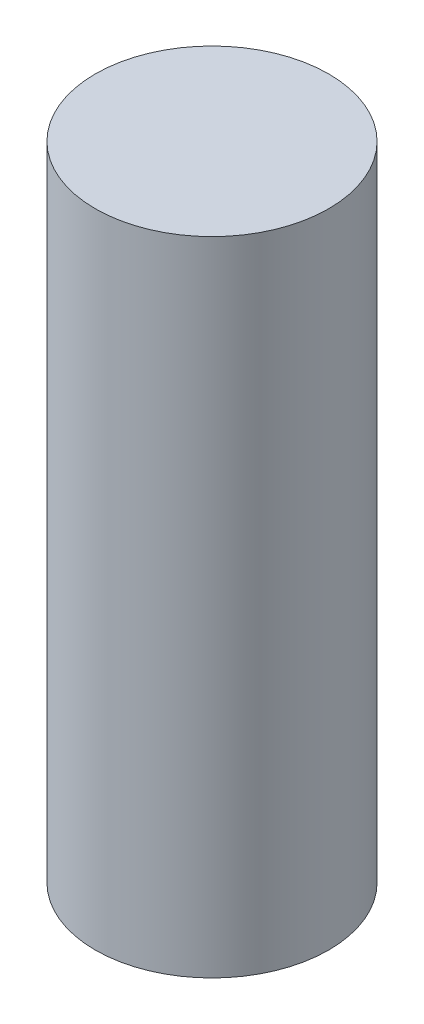
ISO-10303-21;
HEADER;
FILE_DESCRIPTION(('STEP AP214'),'2;1');
FILE_NAME('part.step','',(''),(''),'','','');
FILE_SCHEMA(('AUTOMOTIVE_DESIGN { 1 0 10303 214 1 1 1 1 }'));
ENDSEC;
DATA;
#1=APPLICATION_CONTEXT('core data for automotive mechanical design processes');
#2=APPLICATION_PROTOCOL_DEFINITION('international standard','automotive_design',2000,#1);
#3=PRODUCT_CONTEXT('',#1,'mechanical');
#4=PRODUCT('Part','Part','',(#3));
#5=PRODUCT_RELATED_PRODUCT_CATEGORY('part','',(#4));
#6=PRODUCT_DEFINITION_FORMATION('','',#4);
#7=PRODUCT_DEFINITION_CONTEXT('part definition',#1,'design');
#8=PRODUCT_DEFINITION('design','',#6,#7);
#9=PRODUCT_DEFINITION_SHAPE('','',#8);
#10=(LENGTH_UNIT() NAMED_UNIT(*) SI_UNIT(.MILLI.,.METRE.));
#11=(NAMED_UNIT(*) PLANE_ANGLE_UNIT() SI_UNIT($,.RADIAN.));
#12=(NAMED_UNIT(*) SI_UNIT($,.STERADIAN.) SOLID_ANGLE_UNIT());
#13=UNCERTAINTY_MEASURE_WITH_UNIT(LENGTH_MEASURE(1.E-05),#10,'distance_accuracy_value','');
#14=(GEOMETRIC_REPRESENTATION_CONTEXT(3) GLOBAL_UNCERTAINTY_ASSIGNED_CONTEXT((#13)) GLOBAL_UNIT_ASSIGNED_CONTEXT((#10,
#11,#12)) REPRESENTATION_CONTEXT('',''));
#15=CARTESIAN_POINT('',(0.,0.,0.));
#16=DIRECTION('',(0.,0.,1.));
#17=DIRECTION('',(1.,0.,0.));
#18=AXIS2_PLACEMENT_3D('',#15,#16,#17);
#19=CARTESIAN_POINT('',(0.,11.,0.));
#20=DIRECTION('',(0.,-1.,0.));
#21=DIRECTION('',(0.,0.,-1.));
#22=AXIS2_PLACEMENT_3D('',#19,#20,#21);
#23=CYLINDRICAL_SURFACE('',#22,2.);
#24=CARTESIAN_POINT('',(0.,11.,0.));
#25=DIRECTION('',(0.,1.,0.));
#26=DIRECTION('',(0.,0.,1.));
#27=AXIS2_PLACEMENT_3D('',#24,#25,#26);
#28=CIRCLE('',#27,2.);
#29=CARTESIAN_POINT('',(0.,11.,2.));
#30=VERTEX_POINT('',#29);
#31=EDGE_CURVE('E10',#30,#30,#28,.T.);
#32=ORIENTED_EDGE('',*,*,#31,.F.);
#33=EDGE_LOOP('',(#32));
#34=FACE_BOUND('',#33,.T.);
#35=CARTESIAN_POINT('',(0.,0.,0.));
#36=DIRECTION('',(0.,1.,0.));
#37=DIRECTION('',(0.,0.,1.));
#38=AXIS2_PLACEMENT_3D('',#35,#36,#37);
#39=CIRCLE('',#38,2.);
#40=CARTESIAN_POINT('',(0.,0.,2.));
#41=VERTEX_POINT('',#40);
#42=EDGE_CURVE('E40',#41,#41,#39,.T.);
#43=ORIENTED_EDGE('',*,*,#42,.T.);
#44=EDGE_LOOP('',(#43));
#45=FACE_BOUND('',#44,.T.);
#46=ADVANCED_FACE('F37',(#34,#45),#23,.T.);
#47=CARTESIAN_POINT('',(0.,11.,0.));
#48=DIRECTION('',(0.,1.,0.));
#49=DIRECTION('',(0.,0.,1.));
#50=AXIS2_PLACEMENT_3D('',#47,#48,#49);
#51=PLANE('',#50);
#52=ORIENTED_EDGE('',*,*,#31,.T.);
#53=EDGE_LOOP('',(#52));
#54=FACE_BOUND('',#53,.T.);
#55=ADVANCED_FACE('F54',(#54),#51,.T.);
#56=CARTESIAN_POINT('',(0.,0.,0.));
#57=DIRECTION('',(0.,1.,0.));
#58=DIRECTION('',(0.,0.,1.));
#59=AXIS2_PLACEMENT_3D('',#56,#57,#58);
#60=PLANE('',#59);
#61=ORIENTED_EDGE('',*,*,#42,.F.);
#62=EDGE_LOOP('',(#61));
#63=FACE_BOUND('',#62,.T.);
#64=ADVANCED_FACE('F52',(#63),#60,.F.);
#65=CLOSED_SHELL('',(#46,#55,#64));
#66=MANIFOLD_SOLID_BREP('B2',#65);
#67=ADVANCED_BREP_SHAPE_REPRESENTATION('',(#18,#66),#14);
#68=SHAPE_DEFINITION_REPRESENTATION(#9,#67);
ENDSEC;
END-ISO-10303-21;
